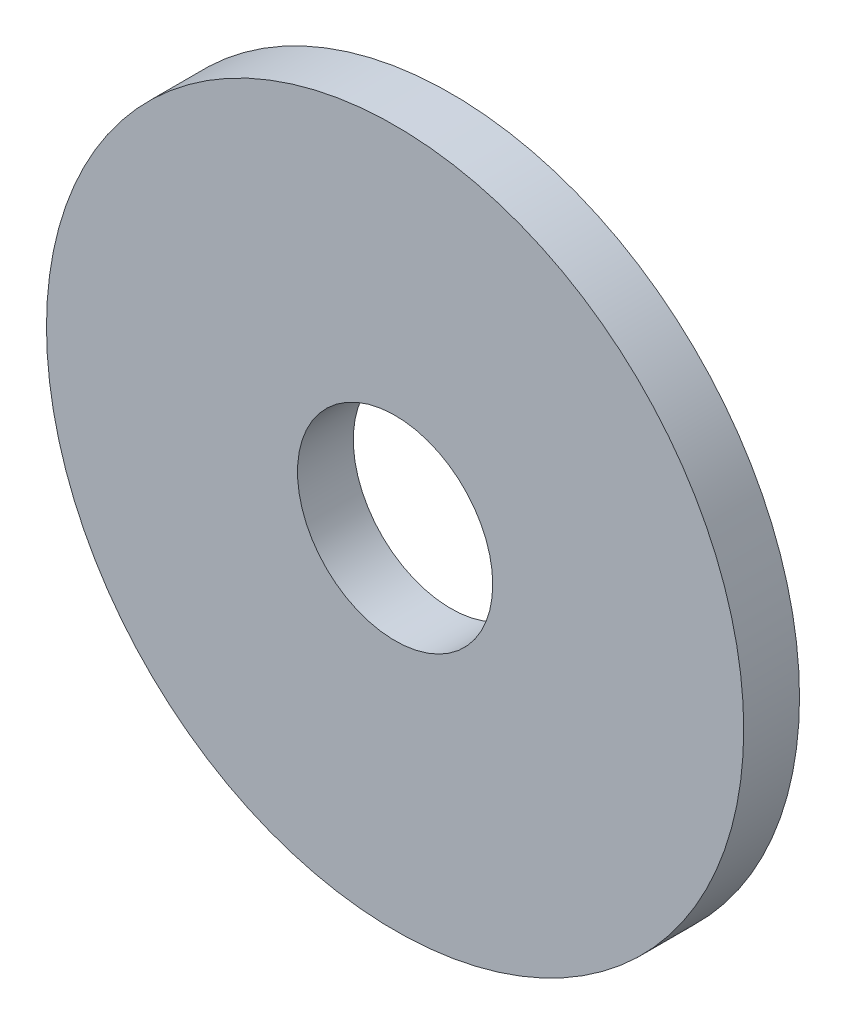
ISO-10303-21;
HEADER;
FILE_DESCRIPTION(('STEP AP214'),'2;1');
FILE_NAME('part.step','',(''),(''),'','','');
FILE_SCHEMA(('AUTOMOTIVE_DESIGN { 1 0 10303 214 1 1 1 1 }'));
ENDSEC;
DATA;
#1=APPLICATION_CONTEXT('core data for automotive mechanical design processes');
#2=APPLICATION_PROTOCOL_DEFINITION('international standard','automotive_design',2000,#1);
#3=PRODUCT_CONTEXT('',#1,'mechanical');
#4=PRODUCT('Part','Part','',(#3));
#5=PRODUCT_RELATED_PRODUCT_CATEGORY('part','',(#4));
#6=PRODUCT_DEFINITION_FORMATION('','',#4);
#7=PRODUCT_DEFINITION_CONTEXT('part definition',#1,'design');
#8=PRODUCT_DEFINITION('design','',#6,#7);
#9=PRODUCT_DEFINITION_SHAPE('','',#8);
#10=(LENGTH_UNIT() NAMED_UNIT(*) SI_UNIT(.MILLI.,.METRE.));
#11=(NAMED_UNIT(*) PLANE_ANGLE_UNIT() SI_UNIT($,.RADIAN.));
#12=(NAMED_UNIT(*) SI_UNIT($,.STERADIAN.) SOLID_ANGLE_UNIT());
#13=UNCERTAINTY_MEASURE_WITH_UNIT(LENGTH_MEASURE(1.E-05),#10,'distance_accuracy_value','');
#14=(GEOMETRIC_REPRESENTATION_CONTEXT(3) GLOBAL_UNCERTAINTY_ASSIGNED_CONTEXT((#13)) GLOBAL_UNIT_ASSIGNED_CONTEXT((#10,
#11,#12)) REPRESENTATION_CONTEXT('',''));
#15=CARTESIAN_POINT('',(0.,0.,0.));
#16=DIRECTION('',(0.,0.,1.));
#17=DIRECTION('',(1.,0.,0.));
#18=AXIS2_PLACEMENT_3D('',#15,#16,#17);
#19=CARTESIAN_POINT('',(0.,0.,2.));
#20=DIRECTION('',(0.,0.,1.));
#21=DIRECTION('',(1.,0.,0.));
#22=AXIS2_PLACEMENT_3D('',#19,#20,#21);
#23=PLANE('',#22);
#24=CARTESIAN_POINT('',(0.,0.,2.));
#25=DIRECTION('',(0.,0.,1.));
#26=DIRECTION('',(1.,0.,0.));
#27=AXIS2_PLACEMENT_3D('',#24,#25,#26);
#28=CIRCLE('',#27,12.5);
#29=CARTESIAN_POINT('',(12.5,0.,2.));
#30=VERTEX_POINT('',#29);
#31=EDGE_CURVE('E10',#30,#30,#28,.T.);
#32=ORIENTED_EDGE('',*,*,#31,.T.);
#33=EDGE_LOOP('',(#32));
#34=FACE_BOUND('',#33,.T.);
#35=CARTESIAN_POINT('',(0.,0.,2.));
#36=DIRECTION('',(0.,0.,1.));
#37=DIRECTION('',(1.,0.,0.));
#38=AXIS2_PLACEMENT_3D('',#35,#36,#37);
#39=CIRCLE('',#38,3.5);
#40=CARTESIAN_POINT('',(3.5,0.,2.));
#41=VERTEX_POINT('',#40);
#42=EDGE_CURVE('E40',#41,#41,#39,.T.);
#43=ORIENTED_EDGE('',*,*,#42,.F.);
#44=EDGE_LOOP('',(#43));
#45=FACE_BOUND('',#44,.T.);
#46=ADVANCED_FACE('F29',(#34,#45),#23,.T.);
#47=CARTESIAN_POINT('',(0.,0.,0.));
#48=DIRECTION('',(0.,0.,1.));
#49=DIRECTION('',(1.,0.,0.));
#50=AXIS2_PLACEMENT_3D('',#47,#48,#49);
#51=PLANE('',#50);
#52=CARTESIAN_POINT('',(0.,0.,0.));
#53=DIRECTION('',(0.,0.,1.));
#54=DIRECTION('',(1.,0.,0.));
#55=AXIS2_PLACEMENT_3D('',#52,#53,#54);
#56=CIRCLE('',#55,12.5);
#57=CARTESIAN_POINT('',(12.5,0.,0.));
#58=VERTEX_POINT('',#57);
#59=EDGE_CURVE('E36',#58,#58,#56,.T.);
#60=ORIENTED_EDGE('',*,*,#59,.F.);
#61=EDGE_LOOP('',(#60));
#62=FACE_BOUND('',#61,.T.);
#63=CARTESIAN_POINT('',(0.,0.,0.));
#64=DIRECTION('',(0.,0.,1.));
#65=DIRECTION('',(1.,0.,0.));
#66=AXIS2_PLACEMENT_3D('',#63,#64,#65);
#67=CIRCLE('',#66,3.5);
#68=CARTESIAN_POINT('',(3.5,0.,0.));
#69=VERTEX_POINT('',#68);
#70=EDGE_CURVE('E44',#69,#69,#67,.T.);
#71=ORIENTED_EDGE('',*,*,#70,.T.);
#72=EDGE_LOOP('',(#71));
#73=FACE_BOUND('',#72,.T.);
#74=ADVANCED_FACE('F50',(#62,#73),#51,.F.);
#75=CARTESIAN_POINT('',(0.,0.,2.));
#76=DIRECTION('',(0.,0.,-1.));
#77=DIRECTION('',(-1.,0.,0.));
#78=AXIS2_PLACEMENT_3D('',#75,#76,#77);
#79=CYLINDRICAL_SURFACE('',#78,12.5);
#80=ORIENTED_EDGE('',*,*,#31,.F.);
#81=EDGE_LOOP('',(#80));
#82=FACE_BOUND('',#81,.T.);
#83=ORIENTED_EDGE('',*,*,#59,.T.);
#84=EDGE_LOOP('',(#83));
#85=FACE_BOUND('',#84,.T.);
#86=ADVANCED_FACE('F31',(#82,#85),#79,.T.);
#87=CARTESIAN_POINT('',(0.,0.,2.));
#88=DIRECTION('',(0.,0.,-1.));
#89=DIRECTION('',(-1.,0.,0.));
#90=AXIS2_PLACEMENT_3D('',#87,#88,#89);
#91=CYLINDRICAL_SURFACE('',#90,3.5);
#92=ORIENTED_EDGE('',*,*,#42,.T.);
#93=EDGE_LOOP('',(#92));
#94=FACE_BOUND('',#93,.T.);
#95=ORIENTED_EDGE('',*,*,#70,.F.);
#96=EDGE_LOOP('',(#95));
#97=FACE_BOUND('',#96,.T.);
#98=ADVANCED_FACE('F52',(#94,#97),#91,.F.);
#99=CLOSED_SHELL('',(#46,#74,#86,#98));
#100=MANIFOLD_SOLID_BREP('B2',#99);
#101=ADVANCED_BREP_SHAPE_REPRESENTATION('',(#18,#100),#14);
#102=SHAPE_DEFINITION_REPRESENTATION(#9,#101);
ENDSEC;
END-ISO-10303-21;
